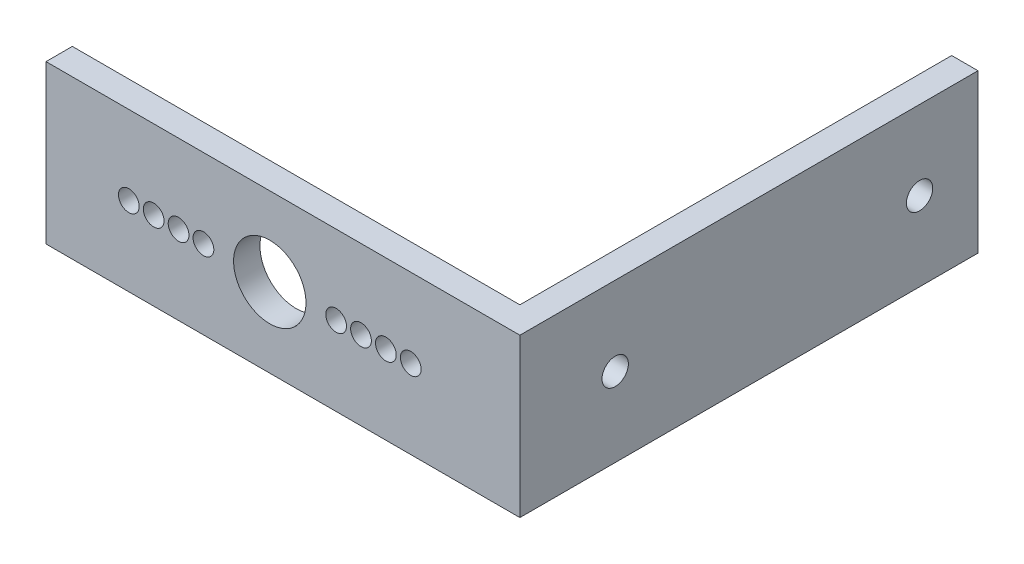
ISO-10303-21;
HEADER;
FILE_DESCRIPTION(('STEP AP214'),'2;1');
FILE_NAME('part.step','',(''),(''),'','','');
FILE_SCHEMA(('AUTOMOTIVE_DESIGN { 1 0 10303 214 1 1 1 1 }'));
ENDSEC;
DATA;
#1=APPLICATION_CONTEXT('core data for automotive mechanical design processes');
#2=APPLICATION_PROTOCOL_DEFINITION('international standard','automotive_design',2000,#1);
#3=PRODUCT_CONTEXT('',#1,'mechanical');
#4=PRODUCT('Part','Part','',(#3));
#5=PRODUCT_RELATED_PRODUCT_CATEGORY('part','',(#4));
#6=PRODUCT_DEFINITION_FORMATION('','',#4);
#7=PRODUCT_DEFINITION_CONTEXT('part definition',#1,'design');
#8=PRODUCT_DEFINITION('design','',#6,#7);
#9=PRODUCT_DEFINITION_SHAPE('','',#8);
#10=(LENGTH_UNIT() NAMED_UNIT(*) SI_UNIT(.MILLI.,.METRE.));
#11=(NAMED_UNIT(*) PLANE_ANGLE_UNIT() SI_UNIT($,.RADIAN.));
#12=(NAMED_UNIT(*) SI_UNIT($,.STERADIAN.) SOLID_ANGLE_UNIT());
#13=UNCERTAINTY_MEASURE_WITH_UNIT(LENGTH_MEASURE(1.E-05),#10,'distance_accuracy_value','');
#14=(GEOMETRIC_REPRESENTATION_CONTEXT(3) GLOBAL_UNCERTAINTY_ASSIGNED_CONTEXT((#13)) GLOBAL_UNIT_ASSIGNED_CONTEXT((#10,
#11,#12)) REPRESENTATION_CONTEXT('',''));
#15=CARTESIAN_POINT('',(0.,0.,0.));
#16=DIRECTION('',(0.,0.,1.));
#17=DIRECTION('',(1.,0.,0.));
#18=AXIS2_PLACEMENT_3D('',#15,#16,#17);
#19=CARTESIAN_POINT('',(0.,0.,3.175));
#20=DIRECTION('',(0.,0.,-1.));
#21=DIRECTION('',(-1.,0.,0.));
#22=AXIS2_PLACEMENT_3D('',#19,#20,#21);
#23=PLANE('',#22);
#24=DIRECTION('',(0.,-1.,0.));
#25=VECTOR('',#24,1.);
#26=CARTESIAN_POINT('',(0.,0.,3.175));
#27=LINE('',#26,#25);
#28=CARTESIAN_POINT('',(0.,19.05,3.175));
#29=VERTEX_POINT('',#28);
#30=CARTESIAN_POINT('',(0.,0.,3.175));
#31=VERTEX_POINT('',#30);
#32=EDGE_CURVE('E89',#29,#31,#27,.T.);
#33=ORIENTED_EDGE('',*,*,#32,.T.);
#34=DIRECTION('',(1.,0.,0.));
#35=VECTOR('',#34,1.);
#36=CARTESIAN_POINT('',(0.,0.,3.175));
#37=LINE('',#36,#35);
#38=CARTESIAN_POINT('',(57.15,0.,3.175));
#39=VERTEX_POINT('',#38);
#40=EDGE_CURVE('E134',#31,#39,#37,.T.);
#41=ORIENTED_EDGE('',*,*,#40,.T.);
#42=DIRECTION('',(0.,-1.,0.));
#43=VECTOR('',#42,1.);
#44=CARTESIAN_POINT('',(57.15,0.,3.175));
#45=LINE('',#44,#43);
#46=CARTESIAN_POINT('',(57.15,19.05,3.175));
#47=VERTEX_POINT('',#46);
#48=EDGE_CURVE('E138',#47,#39,#45,.T.);
#49=ORIENTED_EDGE('',*,*,#48,.F.);
#50=DIRECTION('',(-1.,0.,0.));
#51=VECTOR('',#50,1.);
#52=CARTESIAN_POINT('',(0.,19.05,3.175));
#53=LINE('',#52,#51);
#54=EDGE_CURVE('E59',#47,#29,#53,.T.);
#55=ORIENTED_EDGE('',*,*,#54,.T.);
#56=EDGE_LOOP('',(#33,#41,#49,#55));
#57=FACE_BOUND('',#56,.T.);
#58=CARTESIAN_POINT('',(34.9875114,9.525,3.175));
#59=DIRECTION('',(0.,0.,1.));
#60=DIRECTION('',(1.,0.,0.));
#61=AXIS2_PLACEMENT_3D('',#58,#59,#60);
#62=CIRCLE('',#61,1.25);
#63=CARTESIAN_POINT('',(36.2375114,9.525,3.175));
#64=VERTEX_POINT('',#63);
#65=EDGE_CURVE('E100',#64,#64,#62,.T.);
#66=ORIENTED_EDGE('',*,*,#65,.F.);
#67=EDGE_LOOP('',(#66));
#68=FACE_BOUND('',#67,.T.);
#69=CARTESIAN_POINT('',(43.9874934,9.525,3.175));
#70=DIRECTION('',(0.,0.,1.));
#71=DIRECTION('',(1.,0.,0.));
#72=AXIS2_PLACEMENT_3D('',#69,#70,#71);
#73=CIRCLE('',#72,1.25);
#74=CARTESIAN_POINT('',(45.2374934,9.525,3.175));
#75=VERTEX_POINT('',#74);
#76=EDGE_CURVE('E235',#75,#75,#73,.T.);
#77=ORIENTED_EDGE('',*,*,#76,.F.);
#78=EDGE_LOOP('',(#77));
#79=FACE_BOUND('',#78,.T.);
#80=CARTESIAN_POINT('',(37.9875054,9.525,3.175));
#81=DIRECTION('',(0.,0.,1.));
#82=DIRECTION('',(1.,0.,0.));
#83=AXIS2_PLACEMENT_3D('',#80,#81,#82);
#84=CIRCLE('',#83,1.25);
#85=CARTESIAN_POINT('',(39.2375054,9.525,3.175));
#86=VERTEX_POINT('',#85);
#87=EDGE_CURVE('E227',#86,#86,#84,.T.);
#88=ORIENTED_EDGE('',*,*,#87,.F.);
#89=EDGE_LOOP('',(#88));
#90=FACE_BOUND('',#89,.T.);
#91=CARTESIAN_POINT('',(40.9874994,9.525,3.175));
#92=DIRECTION('',(0.,0.,1.));
#93=DIRECTION('',(1.,0.,0.));
#94=AXIS2_PLACEMENT_3D('',#91,#92,#93);
#95=CIRCLE('',#94,1.25);
#96=CARTESIAN_POINT('',(42.2374994,9.525,3.175));
#97=VERTEX_POINT('',#96);
#98=EDGE_CURVE('E219',#97,#97,#95,.T.);
#99=ORIENTED_EDGE('',*,*,#98,.F.);
#100=EDGE_LOOP('',(#99));
#101=FACE_BOUND('',#100,.T.);
#102=CARTESIAN_POINT('',(26.9875,9.525,3.175));
#103=DIRECTION('',(0.,0.,1.));
#104=DIRECTION('',(1.,0.,0.));
#105=AXIS2_PLACEMENT_3D('',#102,#103,#104);
#106=CIRCLE('',#105,4.365625);
#107=CARTESIAN_POINT('',(31.353125,9.525,3.175));
#108=VERTEX_POINT('',#107);
#109=EDGE_CURVE('E211',#108,#108,#106,.T.);
#110=ORIENTED_EDGE('',*,*,#109,.F.);
#111=EDGE_LOOP('',(#110));
#112=FACE_BOUND('',#111,.T.);
#113=CARTESIAN_POINT('',(18.9874886,9.525,3.175));
#114=DIRECTION('',(0.,0.,1.));
#115=DIRECTION('',(1.,0.,0.));
#116=AXIS2_PLACEMENT_3D('',#113,#114,#115);
#117=CIRCLE('',#116,1.25);
#118=CARTESIAN_POINT('',(20.2374886,9.525,3.175));
#119=VERTEX_POINT('',#118);
#120=EDGE_CURVE('E203',#119,#119,#117,.T.);
#121=ORIENTED_EDGE('',*,*,#120,.F.);
#122=EDGE_LOOP('',(#121));
#123=FACE_BOUND('',#122,.T.);
#124=CARTESIAN_POINT('',(9.98750659999999,9.52500000000001,3.175));
#125=DIRECTION('',(0.,0.,1.));
#126=DIRECTION('',(1.,0.,0.));
#127=AXIS2_PLACEMENT_3D('',#124,#125,#126);
#128=CIRCLE('',#127,1.25);
#129=CARTESIAN_POINT('',(11.2375066,9.52500000000001,3.175));
#130=VERTEX_POINT('',#129);
#131=EDGE_CURVE('E195',#130,#130,#128,.T.);
#132=ORIENTED_EDGE('',*,*,#131,.F.);
#133=EDGE_LOOP('',(#132));
#134=FACE_BOUND('',#133,.T.);
#135=CARTESIAN_POINT('',(15.9874946,9.525,3.175));
#136=DIRECTION('',(0.,0.,1.));
#137=DIRECTION('',(1.,0.,0.));
#138=AXIS2_PLACEMENT_3D('',#135,#136,#137);
#139=CIRCLE('',#138,1.25);
#140=CARTESIAN_POINT('',(17.2374946,9.525,3.175));
#141=VERTEX_POINT('',#140);
#142=EDGE_CURVE('E187',#141,#141,#139,.T.);
#143=ORIENTED_EDGE('',*,*,#142,.F.);
#144=EDGE_LOOP('',(#143));
#145=FACE_BOUND('',#144,.T.);
#146=CARTESIAN_POINT('',(12.9875006,9.52500000000001,3.175));
#147=DIRECTION('',(0.,0.,1.));
#148=DIRECTION('',(1.,0.,0.));
#149=AXIS2_PLACEMENT_3D('',#146,#147,#148);
#150=CIRCLE('',#149,1.25);
#151=CARTESIAN_POINT('',(14.2375006,9.52500000000001,3.175));
#152=VERTEX_POINT('',#151);
#153=EDGE_CURVE('E179',#152,#152,#150,.T.);
#154=ORIENTED_EDGE('',*,*,#153,.F.);
#155=EDGE_LOOP('',(#154));
#156=FACE_BOUND('',#155,.T.);
#157=ADVANCED_FACE('F41',(#57,#68,#79,#90,#101,#112,#123,#134,#145,#156),#23,.F.);
#158=CARTESIAN_POINT('',(0.,0.,0.));
#159=DIRECTION('',(0.,0.,-1.));
#160=DIRECTION('',(-1.,0.,0.));
#161=AXIS2_PLACEMENT_3D('',#158,#159,#160);
#162=PLANE('',#161);
#163=CARTESIAN_POINT('',(15.9874946,9.525,0.));
#164=DIRECTION('',(0.,0.,1.));
#165=DIRECTION('',(1.,0.,0.));
#166=AXIS2_PLACEMENT_3D('',#163,#164,#165);
#167=CIRCLE('',#166,1.25);
#168=CARTESIAN_POINT('',(17.2374946,9.525,0.));
#169=VERTEX_POINT('',#168);
#170=EDGE_CURVE('E183',#169,#169,#167,.T.);
#171=ORIENTED_EDGE('',*,*,#170,.T.);
#172=EDGE_LOOP('',(#171));
#173=FACE_BOUND('',#172,.T.);
#174=CARTESIAN_POINT('',(18.9874886,9.525,0.));
#175=DIRECTION('',(0.,0.,1.));
#176=DIRECTION('',(1.,0.,0.));
#177=AXIS2_PLACEMENT_3D('',#174,#175,#176);
#178=CIRCLE('',#177,1.25);
#179=CARTESIAN_POINT('',(20.2374886,9.525,0.));
#180=VERTEX_POINT('',#179);
#181=EDGE_CURVE('E199',#180,#180,#178,.T.);
#182=ORIENTED_EDGE('',*,*,#181,.T.);
#183=EDGE_LOOP('',(#182));
#184=FACE_BOUND('',#183,.T.);
#185=CARTESIAN_POINT('',(40.9874994,9.525,0.));
#186=DIRECTION('',(0.,0.,1.));
#187=DIRECTION('',(1.,0.,0.));
#188=AXIS2_PLACEMENT_3D('',#185,#186,#187);
#189=CIRCLE('',#188,1.25);
#190=CARTESIAN_POINT('',(42.2374994,9.525,0.));
#191=VERTEX_POINT('',#190);
#192=EDGE_CURVE('E215',#191,#191,#189,.T.);
#193=ORIENTED_EDGE('',*,*,#192,.T.);
#194=EDGE_LOOP('',(#193));
#195=FACE_BOUND('',#194,.T.);
#196=CARTESIAN_POINT('',(43.9874934,9.525,0.));
#197=DIRECTION('',(0.,0.,1.));
#198=DIRECTION('',(1.,0.,0.));
#199=AXIS2_PLACEMENT_3D('',#196,#197,#198);
#200=CIRCLE('',#199,1.25);
#201=CARTESIAN_POINT('',(45.2374934,9.525,0.));
#202=VERTEX_POINT('',#201);
#203=EDGE_CURVE('E231',#202,#202,#200,.T.);
#204=ORIENTED_EDGE('',*,*,#203,.T.);
#205=EDGE_LOOP('',(#204));
#206=FACE_BOUND('',#205,.T.);
#207=DIRECTION('',(0.,-1.,0.));
#208=VECTOR('',#207,1.);
#209=CARTESIAN_POINT('',(0.,0.,0.));
#210=LINE('',#209,#208);
#211=CARTESIAN_POINT('',(0.,19.05,0.));
#212=VERTEX_POINT('',#211);
#213=CARTESIAN_POINT('',(0.,0.,0.));
#214=VERTEX_POINT('',#213);
#215=EDGE_CURVE('E95',#212,#214,#210,.T.);
#216=ORIENTED_EDGE('',*,*,#215,.F.);
#217=DIRECTION('',(-1.,0.,0.));
#218=VECTOR('',#217,1.);
#219=CARTESIAN_POINT('',(0.,19.05,0.));
#220=LINE('',#219,#218);
#221=CARTESIAN_POINT('',(53.975,19.05,0.));
#222=VERTEX_POINT('',#221);
#223=EDGE_CURVE('E78',#222,#212,#220,.T.);
#224=ORIENTED_EDGE('',*,*,#223,.F.);
#225=DIRECTION('',(0.,1.,0.));
#226=VECTOR('',#225,1.);
#227=CARTESIAN_POINT('',(53.975,0.,0.));
#228=LINE('',#227,#226);
#229=CARTESIAN_POINT('',(53.975,0.,0.));
#230=VERTEX_POINT('',#229);
#231=EDGE_CURVE('E90',#230,#222,#228,.T.);
#232=ORIENTED_EDGE('',*,*,#231,.F.);
#233=DIRECTION('',(1.,0.,0.));
#234=VECTOR('',#233,1.);
#235=CARTESIAN_POINT('',(0.,0.,0.));
#236=LINE('',#235,#234);
#237=EDGE_CURVE('E72',#214,#230,#236,.T.);
#238=ORIENTED_EDGE('',*,*,#237,.F.);
#239=EDGE_LOOP('',(#216,#224,#232,#238));
#240=FACE_BOUND('',#239,.T.);
#241=CARTESIAN_POINT('',(34.9875114,9.525,0.));
#242=DIRECTION('',(0.,0.,1.));
#243=DIRECTION('',(1.,0.,0.));
#244=AXIS2_PLACEMENT_3D('',#241,#242,#243);
#245=CIRCLE('',#244,1.25);
#246=CARTESIAN_POINT('',(36.2375114,9.525,0.));
#247=VERTEX_POINT('',#246);
#248=EDGE_CURVE('E106',#247,#247,#245,.T.);
#249=ORIENTED_EDGE('',*,*,#248,.T.);
#250=EDGE_LOOP('',(#249));
#251=FACE_BOUND('',#250,.T.);
#252=CARTESIAN_POINT('',(37.9875054,9.525,0.));
#253=DIRECTION('',(0.,0.,1.));
#254=DIRECTION('',(1.,0.,0.));
#255=AXIS2_PLACEMENT_3D('',#252,#253,#254);
#256=CIRCLE('',#255,1.25);
#257=CARTESIAN_POINT('',(39.2375054,9.525,0.));
#258=VERTEX_POINT('',#257);
#259=EDGE_CURVE('E223',#258,#258,#256,.T.);
#260=ORIENTED_EDGE('',*,*,#259,.T.);
#261=EDGE_LOOP('',(#260));
#262=FACE_BOUND('',#261,.T.);
#263=CARTESIAN_POINT('',(26.9875,9.525,0.));
#264=DIRECTION('',(0.,0.,1.));
#265=DIRECTION('',(1.,0.,0.));
#266=AXIS2_PLACEMENT_3D('',#263,#264,#265);
#267=CIRCLE('',#266,4.365625);
#268=CARTESIAN_POINT('',(31.353125,9.525,0.));
#269=VERTEX_POINT('',#268);
#270=EDGE_CURVE('E207',#269,#269,#267,.T.);
#271=ORIENTED_EDGE('',*,*,#270,.T.);
#272=EDGE_LOOP('',(#271));
#273=FACE_BOUND('',#272,.T.);
#274=CARTESIAN_POINT('',(9.98750659999999,9.52500000000001,0.));
#275=DIRECTION('',(0.,0.,1.));
#276=DIRECTION('',(1.,0.,0.));
#277=AXIS2_PLACEMENT_3D('',#274,#275,#276);
#278=CIRCLE('',#277,1.25);
#279=CARTESIAN_POINT('',(11.2375066,9.52500000000001,0.));
#280=VERTEX_POINT('',#279);
#281=EDGE_CURVE('E191',#280,#280,#278,.T.);
#282=ORIENTED_EDGE('',*,*,#281,.T.);
#283=EDGE_LOOP('',(#282));
#284=FACE_BOUND('',#283,.T.);
#285=CARTESIAN_POINT('',(12.9875006,9.52500000000001,0.));
#286=DIRECTION('',(0.,0.,1.));
#287=DIRECTION('',(1.,0.,0.));
#288=AXIS2_PLACEMENT_3D('',#285,#286,#287);
#289=CIRCLE('',#288,1.25);
#290=CARTESIAN_POINT('',(14.2375006,9.52500000000001,0.));
#291=VERTEX_POINT('',#290);
#292=EDGE_CURVE('E178',#291,#291,#289,.T.);
#293=ORIENTED_EDGE('',*,*,#292,.T.);
#294=EDGE_LOOP('',(#293));
#295=FACE_BOUND('',#294,.T.);
#296=ADVANCED_FACE('F97',(#173,#184,#195,#206,#240,#251,#262,#273,#284,#295),#162,.T.);
#297=CARTESIAN_POINT('',(0.,0.,3.175));
#298=DIRECTION('',(1.,0.,0.));
#299=DIRECTION('',(0.,0.,-1.));
#300=AXIS2_PLACEMENT_3D('',#297,#298,#299);
#301=PLANE('',#300);
#302=ORIENTED_EDGE('',*,*,#215,.T.);
#303=DIRECTION('',(0.,0.,-1.));
#304=VECTOR('',#303,1.);
#305=CARTESIAN_POINT('',(0.,0.,3.175));
#306=LINE('',#305,#304);
#307=EDGE_CURVE('E11',#31,#214,#306,.T.);
#308=ORIENTED_EDGE('',*,*,#307,.F.);
#309=ORIENTED_EDGE('',*,*,#32,.F.);
#310=DIRECTION('',(0.,0.,-1.));
#311=VECTOR('',#310,1.);
#312=CARTESIAN_POINT('',(0.,19.05,3.175));
#313=LINE('',#312,#311);
#314=EDGE_CURVE('E51',#29,#212,#313,.T.);
#315=ORIENTED_EDGE('',*,*,#314,.T.);
#316=EDGE_LOOP('',(#302,#308,#309,#315));
#317=FACE_BOUND('',#316,.T.);
#318=ADVANCED_FACE('F43',(#317),#301,.F.);
#319=CARTESIAN_POINT('',(0.,0.,3.175));
#320=DIRECTION('',(0.,1.,0.));
#321=DIRECTION('',(0.,0.,1.));
#322=AXIS2_PLACEMENT_3D('',#319,#320,#321);
#323=PLANE('',#322);
#324=ORIENTED_EDGE('',*,*,#237,.T.);
#325=DIRECTION('',(0.,0.,-1.));
#326=VECTOR('',#325,1.);
#327=CARTESIAN_POINT('',(53.975,0.,3.175));
#328=LINE('',#327,#326);
#329=CARTESIAN_POINT('',(53.975,0.,-52.07));
#330=VERTEX_POINT('',#329);
#331=EDGE_CURVE('E118',#230,#330,#328,.T.);
#332=ORIENTED_EDGE('',*,*,#331,.T.);
#333=DIRECTION('',(-1.,0.,0.));
#334=VECTOR('',#333,1.);
#335=CARTESIAN_POINT('',(57.15,0.,-52.07));
#336=LINE('',#335,#334);
#337=CARTESIAN_POINT('',(57.15,0.,-52.07));
#338=VERTEX_POINT('',#337);
#339=EDGE_CURVE('E144',#338,#330,#336,.T.);
#340=ORIENTED_EDGE('',*,*,#339,.F.);
#341=DIRECTION('',(0.,0.,-1.));
#342=VECTOR('',#341,1.);
#343=CARTESIAN_POINT('',(57.15,0.,3.175));
#344=LINE('',#343,#342);
#345=EDGE_CURVE('E141',#39,#338,#344,.T.);
#346=ORIENTED_EDGE('',*,*,#345,.F.);
#347=ORIENTED_EDGE('',*,*,#40,.F.);
#348=ORIENTED_EDGE('',*,*,#307,.T.);
#349=EDGE_LOOP('',(#324,#332,#340,#346,#347,#348));
#350=FACE_BOUND('',#349,.T.);
#351=ADVANCED_FACE('F142',(#350),#323,.F.);
#352=CARTESIAN_POINT('',(0.,19.05,3.175));
#353=DIRECTION('',(0.,-1.,0.));
#354=DIRECTION('',(0.,0.,-1.));
#355=AXIS2_PLACEMENT_3D('',#352,#353,#354);
#356=PLANE('',#355);
#357=ORIENTED_EDGE('',*,*,#223,.T.);
#358=ORIENTED_EDGE('',*,*,#314,.F.);
#359=ORIENTED_EDGE('',*,*,#54,.F.);
#360=DIRECTION('',(0.,0.,1.));
#361=VECTOR('',#360,1.);
#362=CARTESIAN_POINT('',(57.15,19.05,3.175));
#363=LINE('',#362,#361);
#364=CARTESIAN_POINT('',(57.15,19.05,-52.07));
#365=VERTEX_POINT('',#364);
#366=EDGE_CURVE('E154',#365,#47,#363,.T.);
#367=ORIENTED_EDGE('',*,*,#366,.F.);
#368=DIRECTION('',(-1.,0.,0.));
#369=VECTOR('',#368,1.);
#370=CARTESIAN_POINT('',(57.15,19.05,-52.07));
#371=LINE('',#370,#369);
#372=CARTESIAN_POINT('',(53.975,19.05,-52.07));
#373=VERTEX_POINT('',#372);
#374=EDGE_CURVE('E168',#365,#373,#371,.T.);
#375=ORIENTED_EDGE('',*,*,#374,.T.);
#376=DIRECTION('',(0.,0.,1.));
#377=VECTOR('',#376,1.);
#378=CARTESIAN_POINT('',(53.975,19.05,3.175));
#379=LINE('',#378,#377);
#380=EDGE_CURVE('E84',#373,#222,#379,.T.);
#381=ORIENTED_EDGE('',*,*,#380,.T.);
#382=EDGE_LOOP('',(#357,#358,#359,#367,#375,#381));
#383=FACE_BOUND('',#382,.T.);
#384=ADVANCED_FACE('F80',(#383),#356,.F.);
#385=CARTESIAN_POINT('',(34.9875114,9.525,3.175));
#386=DIRECTION('',(0.,0.,-1.));
#387=DIRECTION('',(-1.,0.,0.));
#388=AXIS2_PLACEMENT_3D('',#385,#386,#387);
#389=CYLINDRICAL_SURFACE('',#388,1.25);
#390=ORIENTED_EDGE('',*,*,#65,.T.);
#391=EDGE_LOOP('',(#390));
#392=FACE_BOUND('',#391,.T.);
#393=ORIENTED_EDGE('',*,*,#248,.F.);
#394=EDGE_LOOP('',(#393));
#395=FACE_BOUND('',#394,.T.);
#396=ADVANCED_FACE('F250',(#392,#395),#389,.F.);
#397=CARTESIAN_POINT('',(43.9874934,9.525,3.175));
#398=DIRECTION('',(0.,0.,-1.));
#399=DIRECTION('',(-1.,0.,0.));
#400=AXIS2_PLACEMENT_3D('',#397,#398,#399);
#401=CYLINDRICAL_SURFACE('',#400,1.25);
#402=ORIENTED_EDGE('',*,*,#76,.T.);
#403=EDGE_LOOP('',(#402));
#404=FACE_BOUND('',#403,.T.);
#405=ORIENTED_EDGE('',*,*,#203,.F.);
#406=EDGE_LOOP('',(#405));
#407=FACE_BOUND('',#406,.T.);
#408=ADVANCED_FACE('F252',(#404,#407),#401,.F.);
#409=CARTESIAN_POINT('',(37.9875054,9.525,3.175));
#410=DIRECTION('',(0.,0.,-1.));
#411=DIRECTION('',(-1.,0.,0.));
#412=AXIS2_PLACEMENT_3D('',#409,#410,#411);
#413=CYLINDRICAL_SURFACE('',#412,1.25);
#414=ORIENTED_EDGE('',*,*,#87,.T.);
#415=EDGE_LOOP('',(#414));
#416=FACE_BOUND('',#415,.T.);
#417=ORIENTED_EDGE('',*,*,#259,.F.);
#418=EDGE_LOOP('',(#417));
#419=FACE_BOUND('',#418,.T.);
#420=ADVANCED_FACE('F259',(#416,#419),#413,.F.);
#421=CARTESIAN_POINT('',(40.9874994,9.525,3.175));
#422=DIRECTION('',(0.,0.,-1.));
#423=DIRECTION('',(-1.,0.,0.));
#424=AXIS2_PLACEMENT_3D('',#421,#422,#423);
#425=CYLINDRICAL_SURFACE('',#424,1.25);
#426=ORIENTED_EDGE('',*,*,#98,.T.);
#427=EDGE_LOOP('',(#426));
#428=FACE_BOUND('',#427,.T.);
#429=ORIENTED_EDGE('',*,*,#192,.F.);
#430=EDGE_LOOP('',(#429));
#431=FACE_BOUND('',#430,.T.);
#432=ADVANCED_FACE('F369',(#428,#431),#425,.F.);
#433=CARTESIAN_POINT('',(26.9875,9.525,3.175));
#434=DIRECTION('',(0.,0.,-1.));
#435=DIRECTION('',(-1.,0.,0.));
#436=AXIS2_PLACEMENT_3D('',#433,#434,#435);
#437=CYLINDRICAL_SURFACE('',#436,4.365625);
#438=ORIENTED_EDGE('',*,*,#109,.T.);
#439=EDGE_LOOP('',(#438));
#440=FACE_BOUND('',#439,.T.);
#441=ORIENTED_EDGE('',*,*,#270,.F.);
#442=EDGE_LOOP('',(#441));
#443=FACE_BOUND('',#442,.T.);
#444=ADVANCED_FACE('F365',(#440,#443),#437,.F.);
#445=CARTESIAN_POINT('',(18.9874886,9.525,3.175));
#446=DIRECTION('',(0.,0.,-1.));
#447=DIRECTION('',(-1.,0.,0.));
#448=AXIS2_PLACEMENT_3D('',#445,#446,#447);
#449=CYLINDRICAL_SURFACE('',#448,1.25);
#450=ORIENTED_EDGE('',*,*,#120,.T.);
#451=EDGE_LOOP('',(#450));
#452=FACE_BOUND('',#451,.T.);
#453=ORIENTED_EDGE('',*,*,#181,.F.);
#454=EDGE_LOOP('',(#453));
#455=FACE_BOUND('',#454,.T.);
#456=ADVANCED_FACE('F361',(#452,#455),#449,.F.);
#457=CARTESIAN_POINT('',(9.98750659999999,9.52500000000001,3.175));
#458=DIRECTION('',(0.,0.,-1.));
#459=DIRECTION('',(-1.,0.,0.));
#460=AXIS2_PLACEMENT_3D('',#457,#458,#459);
#461=CYLINDRICAL_SURFACE('',#460,1.25);
#462=ORIENTED_EDGE('',*,*,#131,.T.);
#463=EDGE_LOOP('',(#462));
#464=FACE_BOUND('',#463,.T.);
#465=ORIENTED_EDGE('',*,*,#281,.F.);
#466=EDGE_LOOP('',(#465));
#467=FACE_BOUND('',#466,.T.);
#468=ADVANCED_FACE('F357',(#464,#467),#461,.F.);
#469=CARTESIAN_POINT('',(15.9874946,9.525,3.175));
#470=DIRECTION('',(0.,0.,-1.));
#471=DIRECTION('',(-1.,0.,0.));
#472=AXIS2_PLACEMENT_3D('',#469,#470,#471);
#473=CYLINDRICAL_SURFACE('',#472,1.25);
#474=ORIENTED_EDGE('',*,*,#142,.T.);
#475=EDGE_LOOP('',(#474));
#476=FACE_BOUND('',#475,.T.);
#477=ORIENTED_EDGE('',*,*,#170,.F.);
#478=EDGE_LOOP('',(#477));
#479=FACE_BOUND('',#478,.T.);
#480=ADVANCED_FACE('F353',(#476,#479),#473,.F.);
#481=CARTESIAN_POINT('',(12.9875006,9.52500000000001,3.175));
#482=DIRECTION('',(0.,0.,-1.));
#483=DIRECTION('',(-1.,0.,0.));
#484=AXIS2_PLACEMENT_3D('',#481,#482,#483);
#485=CYLINDRICAL_SURFACE('',#484,1.25);
#486=ORIENTED_EDGE('',*,*,#153,.T.);
#487=EDGE_LOOP('',(#486));
#488=FACE_BOUND('',#487,.T.);
#489=ORIENTED_EDGE('',*,*,#292,.F.);
#490=EDGE_LOOP('',(#489));
#491=FACE_BOUND('',#490,.T.);
#492=ADVANCED_FACE('F305',(#488,#491),#485,.F.);
#493=CARTESIAN_POINT('',(57.15,0.,0.));
#494=DIRECTION('',(-1.,0.,0.));
#495=DIRECTION('',(0.,0.,1.));
#496=AXIS2_PLACEMENT_3D('',#493,#494,#495);
#497=PLANE('',#496);
#498=ORIENTED_EDGE('',*,*,#48,.T.);
#499=ORIENTED_EDGE('',*,*,#345,.T.);
#500=DIRECTION('',(0.,1.,0.));
#501=VECTOR('',#500,1.);
#502=CARTESIAN_POINT('',(57.15,0.,-52.07));
#503=LINE('',#502,#501);
#504=EDGE_CURVE('E148',#338,#365,#503,.T.);
#505=ORIENTED_EDGE('',*,*,#504,.T.);
#506=ORIENTED_EDGE('',*,*,#366,.T.);
#507=EDGE_LOOP('',(#498,#499,#505,#506));
#508=FACE_BOUND('',#507,.T.);
#509=CARTESIAN_POINT('',(57.15,9.525,-8.3185));
#510=DIRECTION('',(1.,0.,0.));
#511=DIRECTION('',(0.,0.,-1.));
#512=AXIS2_PLACEMENT_3D('',#509,#510,#511);
#513=CIRCLE('',#512,1.5875);
#514=CARTESIAN_POINT('',(57.15,9.525,-9.906));
#515=VERTEX_POINT('',#514);
#516=EDGE_CURVE('E171',#515,#515,#513,.T.);
#517=ORIENTED_EDGE('',*,*,#516,.F.);
#518=EDGE_LOOP('',(#517));
#519=FACE_BOUND('',#518,.T.);
#520=CARTESIAN_POINT('',(57.15,9.525,-45.0215));
#521=DIRECTION('',(1.,0.,0.));
#522=DIRECTION('',(0.,0.,-1.));
#523=AXIS2_PLACEMENT_3D('',#520,#521,#522);
#524=CIRCLE('',#523,1.5875);
#525=CARTESIAN_POINT('',(57.15,9.525,-46.609));
#526=VERTEX_POINT('',#525);
#527=EDGE_CURVE('E474',#526,#526,#524,.T.);
#528=ORIENTED_EDGE('',*,*,#527,.F.);
#529=EDGE_LOOP('',(#528));
#530=FACE_BOUND('',#529,.T.);
#531=ADVANCED_FACE('F151',(#508,#519,#530),#497,.F.);
#532=CARTESIAN_POINT('',(53.975,0.,0.));
#533=DIRECTION('',(-1.,0.,0.));
#534=DIRECTION('',(0.,0.,1.));
#535=AXIS2_PLACEMENT_3D('',#532,#533,#534);
#536=PLANE('',#535);
#537=CARTESIAN_POINT('',(53.975,9.525,-8.3185));
#538=DIRECTION('',(1.,0.,0.));
#539=DIRECTION('',(0.,0.,-1.));
#540=AXIS2_PLACEMENT_3D('',#537,#538,#539);
#541=CIRCLE('',#540,1.5875);
#542=CARTESIAN_POINT('',(53.975,9.525,-9.906));
#543=VERTEX_POINT('',#542);
#544=EDGE_CURVE('E161',#543,#543,#541,.T.);
#545=ORIENTED_EDGE('',*,*,#544,.T.);
#546=EDGE_LOOP('',(#545));
#547=FACE_BOUND('',#546,.T.);
#548=ORIENTED_EDGE('',*,*,#331,.F.);
#549=ORIENTED_EDGE('',*,*,#231,.T.);
#550=ORIENTED_EDGE('',*,*,#380,.F.);
#551=DIRECTION('',(0.,1.,0.));
#552=VECTOR('',#551,1.);
#553=CARTESIAN_POINT('',(53.975,0.,-52.07));
#554=LINE('',#553,#552);
#555=EDGE_CURVE('E158',#330,#373,#554,.T.);
#556=ORIENTED_EDGE('',*,*,#555,.F.);
#557=EDGE_LOOP('',(#548,#549,#550,#556));
#558=FACE_BOUND('',#557,.T.);
#559=CARTESIAN_POINT('',(53.975,9.525,-45.0215));
#560=DIRECTION('',(1.,0.,0.));
#561=DIRECTION('',(0.,0.,-1.));
#562=AXIS2_PLACEMENT_3D('',#559,#560,#561);
#563=CIRCLE('',#562,1.5875);
#564=CARTESIAN_POINT('',(53.975,9.525,-46.609));
#565=VERTEX_POINT('',#564);
#566=EDGE_CURVE('E477',#565,#565,#563,.T.);
#567=ORIENTED_EDGE('',*,*,#566,.T.);
#568=EDGE_LOOP('',(#567));
#569=FACE_BOUND('',#568,.T.);
#570=ADVANCED_FACE('F114',(#547,#558,#569),#536,.T.);
#571=CARTESIAN_POINT('',(57.15,0.,-52.07));
#572=DIRECTION('',(0.,0.,1.));
#573=DIRECTION('',(1.,0.,0.));
#574=AXIS2_PLACEMENT_3D('',#571,#572,#573);
#575=PLANE('',#574);
#576=ORIENTED_EDGE('',*,*,#555,.T.);
#577=ORIENTED_EDGE('',*,*,#374,.F.);
#578=ORIENTED_EDGE('',*,*,#504,.F.);
#579=ORIENTED_EDGE('',*,*,#339,.T.);
#580=EDGE_LOOP('',(#576,#577,#578,#579));
#581=FACE_BOUND('',#580,.T.);
#582=ADVANCED_FACE('F315',(#581),#575,.F.);
#583=CARTESIAN_POINT('',(57.15,9.525,-8.3185));
#584=DIRECTION('',(-1.,0.,0.));
#585=DIRECTION('',(0.,0.,1.));
#586=AXIS2_PLACEMENT_3D('',#583,#584,#585);
#587=CYLINDRICAL_SURFACE('',#586,1.5875);
#588=ORIENTED_EDGE('',*,*,#516,.T.);
#589=EDGE_LOOP('',(#588));
#590=FACE_BOUND('',#589,.T.);
#591=ORIENTED_EDGE('',*,*,#544,.F.);
#592=EDGE_LOOP('',(#591));
#593=FACE_BOUND('',#592,.T.);
#594=ADVANCED_FACE('F325',(#590,#593),#587,.F.);
#595=CARTESIAN_POINT('',(57.15,9.525,-45.0215));
#596=DIRECTION('',(-1.,0.,0.));
#597=DIRECTION('',(0.,0.,1.));
#598=AXIS2_PLACEMENT_3D('',#595,#596,#597);
#599=CYLINDRICAL_SURFACE('',#598,1.5875);
#600=ORIENTED_EDGE('',*,*,#527,.T.);
#601=EDGE_LOOP('',(#600));
#602=FACE_BOUND('',#601,.T.);
#603=ORIENTED_EDGE('',*,*,#566,.F.);
#604=EDGE_LOOP('',(#603));
#605=FACE_BOUND('',#604,.T.);
#606=ADVANCED_FACE('F335',(#602,#605),#599,.F.);
#607=CLOSED_SHELL('',(#157,#296,#318,#351,#384,#396,#408,#420,#432,#444,#456,#468,#480,#492,
#531,#570,#582,#594,#606));
#608=MANIFOLD_SOLID_BREP('B2',#607);
#609=ADVANCED_BREP_SHAPE_REPRESENTATION('',(#18,#608),#14);
#610=SHAPE_DEFINITION_REPRESENTATION(#9,#609);
ENDSEC;
END-ISO-10303-21;
